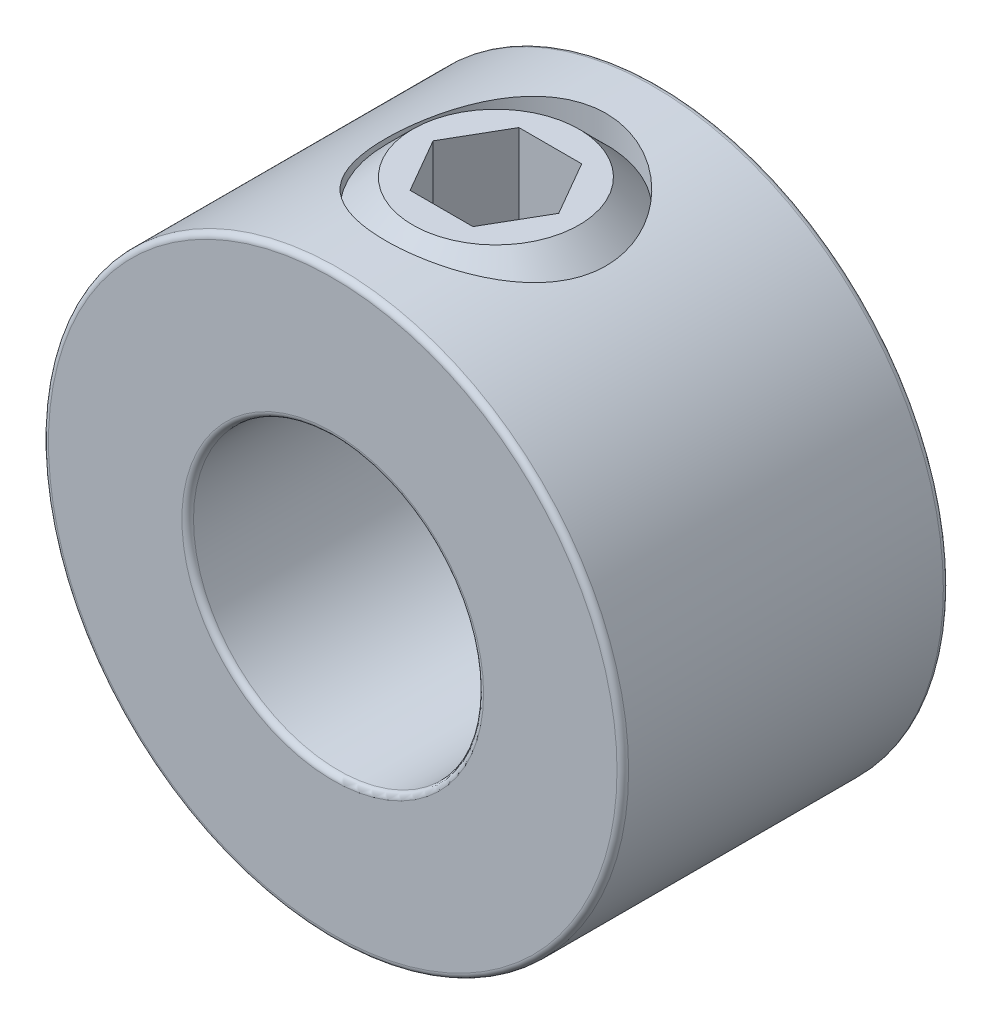
ISO-10303-21;
HEADER;
FILE_DESCRIPTION(('STEP AP214'),'2;1');
FILE_NAME('part.step','',(''),(''),'','','');
FILE_SCHEMA(('AUTOMOTIVE_DESIGN { 1 0 10303 214 1 1 1 1 }'));
ENDSEC;
DATA;
#1=APPLICATION_CONTEXT('core data for automotive mechanical design processes');
#2=APPLICATION_PROTOCOL_DEFINITION('international standard','automotive_design',2000,#1);
#3=PRODUCT_CONTEXT('',#1,'mechanical');
#4=PRODUCT('Part','Part','',(#3));
#5=PRODUCT_RELATED_PRODUCT_CATEGORY('part','',(#4));
#6=PRODUCT_DEFINITION_FORMATION('','',#4);
#7=PRODUCT_DEFINITION_CONTEXT('part definition',#1,'design');
#8=PRODUCT_DEFINITION('design','',#6,#7);
#9=PRODUCT_DEFINITION_SHAPE('','',#8);
#10=(LENGTH_UNIT() NAMED_UNIT(*) SI_UNIT(.MILLI.,.METRE.));
#11=(NAMED_UNIT(*) PLANE_ANGLE_UNIT() SI_UNIT($,.RADIAN.));
#12=(NAMED_UNIT(*) SI_UNIT($,.STERADIAN.) SOLID_ANGLE_UNIT());
#13=UNCERTAINTY_MEASURE_WITH_UNIT(LENGTH_MEASURE(1.E-05),#10,'distance_accuracy_value','');
#14=(GEOMETRIC_REPRESENTATION_CONTEXT(3) GLOBAL_UNCERTAINTY_ASSIGNED_CONTEXT((#13)) GLOBAL_UNIT_ASSIGNED_CONTEXT((#10,
#11,#12)) REPRESENTATION_CONTEXT('',''));
#15=CARTESIAN_POINT('',(0.,0.,0.));
#16=DIRECTION('',(0.,0.,1.));
#17=DIRECTION('',(1.,0.,0.));
#18=AXIS2_PLACEMENT_3D('',#15,#16,#17);
#19=CARTESIAN_POINT('',(0.,6.35,0.));
#20=DIRECTION('',(0.,1.,0.));
#21=DIRECTION('',(-1.,0.,0.));
#22=AXIS2_PLACEMENT_3D('',#19,#20,#21);
#23=PLANE('',#22);
#24=CARTESIAN_POINT('',(0.,6.35,0.));
#25=DIRECTION('',(0.,1.,0.));
#26=DIRECTION('',(-1.,0.,0.));
#27=AXIS2_PLACEMENT_3D('',#24,#25,#26);
#28=CIRCLE('',#27,1.81975161629017);
#29=CARTESIAN_POINT('',(-1.81975161629017,6.35,0.));
#30=VERTEX_POINT('',#29);
#31=EDGE_CURVE('E12',#30,#30,#28,.T.);
#32=ORIENTED_EDGE('',*,*,#31,.T.);
#33=EDGE_LOOP('',(#32));
#34=FACE_BOUND('',#33,.T.);
#35=DIRECTION('',(1.,0.,0.));
#36=VECTOR('',#35,1.);
#37=CARTESIAN_POINT('',(-0.687407664253899,6.34999999999999,-1.190625));
#38=LINE('',#37,#36);
#39=CARTESIAN_POINT('',(-0.687407664253899,6.34999999999999,-1.190625));
#40=VERTEX_POINT('',#39);
#41=CARTESIAN_POINT('',(0.687407664253899,6.35,-1.190625));
#42=VERTEX_POINT('',#41);
#43=EDGE_CURVE('E110',#40,#42,#38,.T.);
#44=ORIENTED_EDGE('',*,*,#43,.T.);
#45=DIRECTION('',(0.5,0.,0.866025403784439));
#46=VECTOR('',#45,1.);
#47=CARTESIAN_POINT('',(0.687407664253899,6.34999999999999,-1.190625));
#48=LINE('',#47,#46);
#49=CARTESIAN_POINT('',(1.3748153285078,6.34999999999999,0.));
#50=VERTEX_POINT('',#49);
#51=EDGE_CURVE('E56',#42,#50,#48,.T.);
#52=ORIENTED_EDGE('',*,*,#51,.T.);
#53=DIRECTION('',(-0.5,0.,0.866025403784439));
#54=VECTOR('',#53,1.);
#55=CARTESIAN_POINT('',(1.3748153285078,6.34999999999999,0.));
#56=LINE('',#55,#54);
#57=CARTESIAN_POINT('',(0.687407664253899,6.34999999999999,1.190625));
#58=VERTEX_POINT('',#57);
#59=EDGE_CURVE('E114',#50,#58,#56,.T.);
#60=ORIENTED_EDGE('',*,*,#59,.T.);
#61=DIRECTION('',(-1.,0.,0.));
#62=VECTOR('',#61,1.);
#63=CARTESIAN_POINT('',(0.687407664253899,6.34999999999999,1.190625));
#64=LINE('',#63,#62);
#65=CARTESIAN_POINT('',(-0.687407664253899,6.34999999999999,1.190625));
#66=VERTEX_POINT('',#65);
#67=EDGE_CURVE('E177',#58,#66,#64,.T.);
#68=ORIENTED_EDGE('',*,*,#67,.T.);
#69=DIRECTION('',(-0.5,0.,-0.866025403784439));
#70=VECTOR('',#69,1.);
#71=CARTESIAN_POINT('',(-0.687407664253899,6.34999999999999,1.190625));
#72=LINE('',#71,#70);
#73=CARTESIAN_POINT('',(-1.3748153285078,6.34999999999999,0.));
#74=VERTEX_POINT('',#73);
#75=EDGE_CURVE('E162',#66,#74,#72,.T.);
#76=ORIENTED_EDGE('',*,*,#75,.T.);
#77=DIRECTION('',(0.5,0.,-0.866025403784439));
#78=VECTOR('',#77,1.);
#79=CARTESIAN_POINT('',(-1.3748153285078,6.34999999999999,0.));
#80=LINE('',#79,#78);
#81=EDGE_CURVE('E158',#74,#40,#80,.T.);
#82=ORIENTED_EDGE('',*,*,#81,.T.);
#83=EDGE_LOOP('',(#44,#52,#60,#68,#76,#82));
#84=FACE_BOUND('',#83,.T.);
#85=ADVANCED_FACE('F42',(#34,#84),#23,.T.);
#86=CARTESIAN_POINT('',(0.,6.35,0.));
#87=DIRECTION('',(0.,-1.,0.));
#88=DIRECTION('',(1.,0.,0.));
#89=AXIS2_PLACEMENT_3D('',#86,#87,#88);
#90=CONICAL_SURFACE('',#89,1.81975161629017,0.785398163397449);
#91=CARTESIAN_POINT('',(0.,5.75675161629017,0.));
#92=DIRECTION('',(0.,1.,0.));
#93=DIRECTION('',(-1.,0.,0.));
#94=AXIS2_PLACEMENT_3D('',#91,#92,#93);
#95=CIRCLE('',#94,2.413);
#96=CARTESIAN_POINT('',(-2.413,5.75675161629017,0.));
#97=VERTEX_POINT('',#96);
#98=EDGE_CURVE('E49',#97,#97,#95,.T.);
#99=ORIENTED_EDGE('',*,*,#98,.T.);
#100=EDGE_LOOP('',(#99));
#101=FACE_BOUND('',#100,.T.);
#102=ORIENTED_EDGE('',*,*,#31,.F.);
#103=EDGE_LOOP('',(#102));
#104=FACE_BOUND('',#103,.T.);
#105=ADVANCED_FACE('F132',(#101,#104),#90,.T.);
#106=CARTESIAN_POINT('',(0.,3.175,0.));
#107=DIRECTION('',(0.,1.,0.));
#108=DIRECTION('',(-1.,0.,0.));
#109=AXIS2_PLACEMENT_3D('',#106,#107,#108);
#110=CYLINDRICAL_SURFACE('',#109,2.413);
#111=CARTESIAN_POINT('',(0.,3.76824838370983,0.));
#112=DIRECTION('',(0.,1.,0.));
#113=DIRECTION('',(-1.,0.,0.));
#114=AXIS2_PLACEMENT_3D('',#111,#112,#113);
#115=CIRCLE('',#114,2.413);
#116=CARTESIAN_POINT('',(-2.413,3.76824838370983,0.));
#117=VERTEX_POINT('',#116);
#118=EDGE_CURVE('E127',#117,#117,#115,.T.);
#119=ORIENTED_EDGE('',*,*,#118,.T.);
#120=EDGE_LOOP('',(#119));
#121=FACE_BOUND('',#120,.T.);
#122=ORIENTED_EDGE('',*,*,#98,.F.);
#123=EDGE_LOOP('',(#122));
#124=FACE_BOUND('',#123,.T.);
#125=ADVANCED_FACE('F135',(#121,#124),#110,.T.);
#126=CARTESIAN_POINT('',(0.,3.76824838370983,0.));
#127=DIRECTION('',(0.,1.,0.));
#128=DIRECTION('',(-1.,0.,0.));
#129=AXIS2_PLACEMENT_3D('',#126,#127,#128);
#130=CONICAL_SURFACE('',#129,2.413,0.785398163397448);
#131=CARTESIAN_POINT('',(0.,3.175,0.));
#132=DIRECTION('',(0.,1.,0.));
#133=DIRECTION('',(-1.,0.,0.));
#134=AXIS2_PLACEMENT_3D('',#131,#132,#133);
#135=CIRCLE('',#134,1.81975161629017);
#136=CARTESIAN_POINT('',(-1.81975161629017,3.175,0.));
#137=VERTEX_POINT('',#136);
#138=EDGE_CURVE('E119',#137,#137,#135,.T.);
#139=ORIENTED_EDGE('',*,*,#138,.T.);
#140=EDGE_LOOP('',(#139));
#141=FACE_BOUND('',#140,.T.);
#142=ORIENTED_EDGE('',*,*,#118,.F.);
#143=EDGE_LOOP('',(#142));
#144=FACE_BOUND('',#143,.T.);
#145=ADVANCED_FACE('F137',(#141,#144),#130,.T.);
#146=CARTESIAN_POINT('',(-1.81975161629017,3.175,0.));
#147=DIRECTION('',(0.,-1.,0.));
#148=DIRECTION('',(1.,0.,0.));
#149=AXIS2_PLACEMENT_3D('',#146,#147,#148);
#150=PLANE('',#149);
#151=CARTESIAN_POINT('',(0.,3.175,0.));
#152=DIRECTION('',(0.,1.,0.));
#153=DIRECTION('',(-1.,0.,0.));
#154=AXIS2_PLACEMENT_3D('',#151,#152,#153);
#155=CIRCLE('',#154,0.711898060451796);
#156=CARTESIAN_POINT('',(-0.711898060451796,3.175,0.));
#157=VERTEX_POINT('',#156);
#158=EDGE_CURVE('E115',#157,#157,#155,.T.);
#159=ORIENTED_EDGE('',*,*,#158,.T.);
#160=EDGE_LOOP('',(#159));
#161=FACE_BOUND('',#160,.T.);
#162=ORIENTED_EDGE('',*,*,#138,.F.);
#163=EDGE_LOOP('',(#162));
#164=FACE_BOUND('',#163,.T.);
#165=ADVANCED_FACE('F144',(#161,#164),#150,.T.);
#166=CARTESIAN_POINT('',(0.,3.175,0.));
#167=DIRECTION('',(0.,-1.,0.));
#168=DIRECTION('',(1.,0.,0.));
#169=AXIS2_PLACEMENT_3D('',#166,#167,#168);
#170=CONICAL_SURFACE('',#169,0.711898060451796,0.785398163397448);
#171=CARTESIAN_POINT('',(0.,3.8868980604518,0.));
#172=VERTEX_POINT('',#171);
#173=VERTEX_LOOP('',#172);
#174=FACE_BOUND('',#173,.T.);
#175=ORIENTED_EDGE('',*,*,#158,.F.);
#176=EDGE_LOOP('',(#175));
#177=FACE_BOUND('',#176,.T.);
#178=ADVANCED_FACE('F211',(#174,#177),#170,.F.);
#179=CARTESIAN_POINT('',(0.687407664253899,3.96874999999999,-1.190625));
#180=DIRECTION('',(-0.866025403784439,0.,0.5));
#181=DIRECTION('',(0.5,0.,0.866025403784438));
#182=AXIS2_PLACEMENT_3D('',#179,#180,#181);
#183=PLANE('',#182);
#184=ORIENTED_EDGE('',*,*,#51,.F.);
#185=DIRECTION('',(0.,1.,0.));
#186=VECTOR('',#185,1.);
#187=CARTESIAN_POINT('',(0.687407664253899,3.96874999999999,-1.190625));
#188=LINE('',#187,#186);
#189=CARTESIAN_POINT('',(0.687407664253899,3.96874999999999,-1.190625));
#190=VERTEX_POINT('',#189);
#191=EDGE_CURVE('E109',#190,#42,#188,.T.);
#192=ORIENTED_EDGE('',*,*,#191,.F.);
#193=DIRECTION('',(0.5,0.,0.866025403784439));
#194=VECTOR('',#193,1.);
#195=CARTESIAN_POINT('',(0.687407664253899,3.96874999999999,-1.190625));
#196=LINE('',#195,#194);
#197=CARTESIAN_POINT('',(1.3748153285078,3.96874999999999,0.));
#198=VERTEX_POINT('',#197);
#199=EDGE_CURVE('E100',#190,#198,#196,.T.);
#200=ORIENTED_EDGE('',*,*,#199,.T.);
#201=DIRECTION('',(0.,1.,0.));
#202=VECTOR('',#201,1.);
#203=CARTESIAN_POINT('',(1.3748153285078,3.96874999999999,0.));
#204=LINE('',#203,#202);
#205=EDGE_CURVE('E108',#198,#50,#204,.T.);
#206=ORIENTED_EDGE('',*,*,#205,.T.);
#207=EDGE_LOOP('',(#184,#192,#200,#206));
#208=FACE_BOUND('',#207,.T.);
#209=ADVANCED_FACE('F107',(#208),#183,.T.);
#210=CARTESIAN_POINT('',(1.3748153285078,3.96874999999999,0.));
#211=DIRECTION('',(-0.866025403784439,0.,-0.5));
#212=DIRECTION('',(-0.5,0.,0.866025403784439));
#213=AXIS2_PLACEMENT_3D('',#210,#211,#212);
#214=PLANE('',#213);
#215=ORIENTED_EDGE('',*,*,#59,.F.);
#216=ORIENTED_EDGE('',*,*,#205,.F.);
#217=DIRECTION('',(-0.5,0.,0.866025403784439));
#218=VECTOR('',#217,1.);
#219=CARTESIAN_POINT('',(1.3748153285078,3.96874999999999,0.));
#220=LINE('',#219,#218);
#221=CARTESIAN_POINT('',(0.687407664253899,3.96874999999999,1.190625));
#222=VERTEX_POINT('',#221);
#223=EDGE_CURVE('E96',#198,#222,#220,.T.);
#224=ORIENTED_EDGE('',*,*,#223,.T.);
#225=DIRECTION('',(0.,1.,0.));
#226=VECTOR('',#225,1.);
#227=CARTESIAN_POINT('',(0.687407664253899,3.96874999999999,1.190625));
#228=LINE('',#227,#226);
#229=EDGE_CURVE('E116',#222,#58,#228,.T.);
#230=ORIENTED_EDGE('',*,*,#229,.T.);
#231=EDGE_LOOP('',(#215,#216,#224,#230));
#232=FACE_BOUND('',#231,.T.);
#233=ADVANCED_FACE('F112',(#232),#214,.T.);
#234=CARTESIAN_POINT('',(0.687407664253899,3.96874999999999,1.190625));
#235=DIRECTION('',(0.,0.,-1.));
#236=DIRECTION('',(-1.,0.,0.));
#237=AXIS2_PLACEMENT_3D('',#234,#235,#236);
#238=PLANE('',#237);
#239=ORIENTED_EDGE('',*,*,#67,.F.);
#240=ORIENTED_EDGE('',*,*,#229,.F.);
#241=DIRECTION('',(-1.,0.,0.));
#242=VECTOR('',#241,1.);
#243=CARTESIAN_POINT('',(0.687407664253899,3.96874999999999,1.190625));
#244=LINE('',#243,#242);
#245=CARTESIAN_POINT('',(-0.687407664253899,3.96874999999999,1.190625));
#246=VERTEX_POINT('',#245);
#247=EDGE_CURVE('E102',#222,#246,#244,.T.);
#248=ORIENTED_EDGE('',*,*,#247,.T.);
#249=DIRECTION('',(0.,1.,0.));
#250=VECTOR('',#249,1.);
#251=CARTESIAN_POINT('',(-0.687407664253899,3.96874999999999,1.190625));
#252=LINE('',#251,#250);
#253=EDGE_CURVE('E121',#246,#66,#252,.T.);
#254=ORIENTED_EDGE('',*,*,#253,.T.);
#255=EDGE_LOOP('',(#239,#240,#248,#254));
#256=FACE_BOUND('',#255,.T.);
#257=ADVANCED_FACE('F175',(#256),#238,.T.);
#258=CARTESIAN_POINT('',(-0.687407664253899,3.96874999999999,1.190625));
#259=DIRECTION('',(0.866025403784439,0.,-0.5));
#260=DIRECTION('',(-0.5,0.,-0.866025403784438));
#261=AXIS2_PLACEMENT_3D('',#258,#259,#260);
#262=PLANE('',#261);
#263=ORIENTED_EDGE('',*,*,#75,.F.);
#264=ORIENTED_EDGE('',*,*,#253,.F.);
#265=DIRECTION('',(-0.5,0.,-0.866025403784439));
#266=VECTOR('',#265,1.);
#267=CARTESIAN_POINT('',(-0.687407664253899,3.96874999999999,1.190625));
#268=LINE('',#267,#266);
#269=CARTESIAN_POINT('',(-1.3748153285078,3.96874999999999,0.));
#270=VERTEX_POINT('',#269);
#271=EDGE_CURVE('E188',#246,#270,#268,.T.);
#272=ORIENTED_EDGE('',*,*,#271,.T.);
#273=DIRECTION('',(0.,1.,0.));
#274=VECTOR('',#273,1.);
#275=CARTESIAN_POINT('',(-1.3748153285078,3.96874999999999,0.));
#276=LINE('',#275,#274);
#277=EDGE_CURVE('E170',#270,#74,#276,.T.);
#278=ORIENTED_EDGE('',*,*,#277,.T.);
#279=EDGE_LOOP('',(#263,#264,#272,#278));
#280=FACE_BOUND('',#279,.T.);
#281=ADVANCED_FACE('F179',(#280),#262,.T.);
#282=CARTESIAN_POINT('',(-1.3748153285078,3.96874999999999,0.));
#283=DIRECTION('',(0.866025403784439,0.,0.5));
#284=DIRECTION('',(0.5,0.,-0.866025403784439));
#285=AXIS2_PLACEMENT_3D('',#282,#283,#284);
#286=PLANE('',#285);
#287=ORIENTED_EDGE('',*,*,#81,.F.);
#288=ORIENTED_EDGE('',*,*,#277,.F.);
#289=DIRECTION('',(0.5,0.,-0.866025403784439));
#290=VECTOR('',#289,1.);
#291=CARTESIAN_POINT('',(-1.3748153285078,3.96874999999999,0.));
#292=LINE('',#291,#290);
#293=CARTESIAN_POINT('',(-0.687407664253899,3.96874999999999,-1.190625));
#294=VERTEX_POINT('',#293);
#295=EDGE_CURVE('E186',#270,#294,#292,.T.);
#296=ORIENTED_EDGE('',*,*,#295,.T.);
#297=DIRECTION('',(0.,1.,0.));
#298=VECTOR('',#297,1.);
#299=CARTESIAN_POINT('',(-0.687407664253899,3.96874999999999,-1.190625));
#300=LINE('',#299,#298);
#301=EDGE_CURVE('E167',#294,#40,#300,.T.);
#302=ORIENTED_EDGE('',*,*,#301,.T.);
#303=EDGE_LOOP('',(#287,#288,#296,#302));
#304=FACE_BOUND('',#303,.T.);
#305=ADVANCED_FACE('F192',(#304),#286,.T.);
#306=CARTESIAN_POINT('',(-0.687407664253899,3.96874999999999,-1.190625));
#307=DIRECTION('',(0.,0.,1.));
#308=DIRECTION('',(1.,0.,0.));
#309=AXIS2_PLACEMENT_3D('',#306,#307,#308);
#310=PLANE('',#309);
#311=ORIENTED_EDGE('',*,*,#43,.F.);
#312=ORIENTED_EDGE('',*,*,#301,.F.);
#313=DIRECTION('',(1.,0.,0.));
#314=VECTOR('',#313,1.);
#315=CARTESIAN_POINT('',(-0.687407664253899,3.96874999999999,-1.190625));
#316=LINE('',#315,#314);
#317=EDGE_CURVE('E168',#294,#190,#316,.T.);
#318=ORIENTED_EDGE('',*,*,#317,.T.);
#319=ORIENTED_EDGE('',*,*,#191,.T.);
#320=EDGE_LOOP('',(#311,#312,#318,#319));
#321=FACE_BOUND('',#320,.T.);
#322=ADVANCED_FACE('F193',(#321),#310,.T.);
#323=CARTESIAN_POINT('',(1.3748153285078,3.96874999999999,0.));
#324=DIRECTION('',(0.,-1.,0.));
#325=DIRECTION('',(0.,0.,-1.));
#326=AXIS2_PLACEMENT_3D('',#323,#324,#325);
#327=PLANE('',#326);
#328=ORIENTED_EDGE('',*,*,#199,.F.);
#329=ORIENTED_EDGE('',*,*,#317,.F.);
#330=ORIENTED_EDGE('',*,*,#295,.F.);
#331=ORIENTED_EDGE('',*,*,#271,.F.);
#332=ORIENTED_EDGE('',*,*,#247,.F.);
#333=ORIENTED_EDGE('',*,*,#223,.F.);
#334=EDGE_LOOP('',(#328,#329,#330,#331,#332,#333));
#335=FACE_BOUND('',#334,.T.);
#336=ADVANCED_FACE('F98',(#335),#327,.F.);
#337=CLOSED_SHELL('',(#85,#105,#125,#145,#165,#178,#209,#233,#257,#281,#305,#322,#336));
#338=MANIFOLD_SOLID_BREP('B2',#337);
#339=CARTESIAN_POINT('',(0.,0.,3.571875));
#340=DIRECTION('',(0.,0.,1.));
#341=DIRECTION('',(1.,0.,0.));
#342=AXIS2_PLACEMENT_3D('',#339,#340,#341);
#343=PLANE('',#342);
#344=CARTESIAN_POINT('',(0.,0.,3.571875));
#345=DIRECTION('',(0.,0.,1.));
#346=DIRECTION('',(1.,0.,0.));
#347=AXIS2_PLACEMENT_3D('',#344,#345,#346);
#348=CIRCLE('',#347,3.302);
#349=CARTESIAN_POINT('',(3.302,0.,3.571875));
#350=VERTEX_POINT('',#349);
#351=EDGE_CURVE('E307',#350,#350,#348,.F.);
#352=ORIENTED_EDGE('',*,*,#351,.T.);
#353=EDGE_LOOP('',(#352));
#354=FACE_BOUND('',#353,.T.);
#355=CARTESIAN_POINT('',(0.,0.,3.571875));
#356=DIRECTION('',(0.,0.,1.));
#357=DIRECTION('',(1.,0.,0.));
#358=AXIS2_PLACEMENT_3D('',#355,#356,#357);
#359=CIRCLE('',#358,6.223);
#360=CARTESIAN_POINT('',(6.223,0.,3.571875));
#361=VERTEX_POINT('',#360);
#362=EDGE_CURVE('E311',#361,#361,#359,.T.);
#363=ORIENTED_EDGE('',*,*,#362,.T.);
#364=EDGE_LOOP('',(#363));
#365=FACE_BOUND('',#364,.T.);
#366=ADVANCED_FACE('F296',(#354,#365),#343,.T.);
#367=CARTESIAN_POINT('',(0.,0.,-3.571875));
#368=DIRECTION('',(0.,0.,1.));
#369=DIRECTION('',(1.,0.,0.));
#370=AXIS2_PLACEMENT_3D('',#367,#368,#369);
#371=PLANE('',#370);
#372=CARTESIAN_POINT('',(0.,0.,-3.571875));
#373=DIRECTION('',(0.,0.,1.));
#374=DIRECTION('',(1.,0.,0.));
#375=AXIS2_PLACEMENT_3D('',#372,#373,#374);
#376=CIRCLE('',#375,3.302);
#377=CARTESIAN_POINT('',(3.302,0.,-3.571875));
#378=VERTEX_POINT('',#377);
#379=EDGE_CURVE('E322',#378,#378,#376,.T.);
#380=ORIENTED_EDGE('',*,*,#379,.T.);
#381=EDGE_LOOP('',(#380));
#382=FACE_BOUND('',#381,.T.);
#383=CARTESIAN_POINT('',(0.,0.,-3.571875));
#384=DIRECTION('',(0.,0.,1.));
#385=DIRECTION('',(1.,0.,0.));
#386=AXIS2_PLACEMENT_3D('',#383,#384,#385);
#387=CIRCLE('',#386,6.223);
#388=CARTESIAN_POINT('',(6.223,0.,-3.571875));
#389=VERTEX_POINT('',#388);
#390=EDGE_CURVE('E325',#389,#389,#387,.F.);
#391=ORIENTED_EDGE('',*,*,#390,.T.);
#392=EDGE_LOOP('',(#391));
#393=FACE_BOUND('',#392,.T.);
#394=ADVANCED_FACE('F359',(#382,#393),#371,.F.);
#395=CARTESIAN_POINT('',(0.,0.,3.571875));
#396=DIRECTION('',(0.,0.,-1.));
#397=DIRECTION('',(-1.,0.,0.));
#398=AXIS2_PLACEMENT_3D('',#395,#396,#397);
#399=CYLINDRICAL_SURFACE('',#398,6.35);
#400=CARTESIAN_POINT('',(0.,0.,-3.444875));
#401=DIRECTION('',(0.,0.,1.));
#402=DIRECTION('',(1.,0.,0.));
#403=AXIS2_PLACEMENT_3D('',#400,#401,#402);
#404=CIRCLE('',#403,6.35);
#405=CARTESIAN_POINT('',(6.35,0.,-3.444875));
#406=VERTEX_POINT('',#405);
#407=EDGE_CURVE('E41',#406,#406,#404,.T.);
#408=ORIENTED_EDGE('',*,*,#407,.T.);
#409=EDGE_LOOP('',(#408));
#410=FACE_BOUND('',#409,.T.);
#411=CARTESIAN_POINT('',(0.,0.,3.444875));
#412=DIRECTION('',(0.,0.,1.));
#413=DIRECTION('',(1.,0.,0.));
#414=AXIS2_PLACEMENT_3D('',#411,#412,#413);
#415=CIRCLE('',#414,6.35);
#416=CARTESIAN_POINT('',(6.35,0.,3.444875));
#417=VERTEX_POINT('',#416);
#418=EDGE_CURVE('E303',#417,#417,#415,.F.);
#419=ORIENTED_EDGE('',*,*,#418,.T.);
#420=EDGE_LOOP('',(#419));
#421=FACE_BOUND('',#420,.T.);
#422=CARTESIAN_POINT('',(0.,6.35,-2.413));
#423=CARTESIAN_POINT('',(0.130555931467962,6.35000398969011,-2.41300527534602));
#424=CARTESIAN_POINT('',(0.261076241377739,6.34593890816647,-2.4023714543113));
#425=CARTESIAN_POINT('',(0.518209446534913,6.33012963929965,-2.36029479676423));
#426=CARTESIAN_POINT('',(0.644823015088655,6.31838678300935,-2.32885556715778));
#427=CARTESIAN_POINT('',(0.890396734122701,6.28848040494,-2.24644511602075));
#428=CARTESIAN_POINT('',(1.00937135935963,6.27032947705095,-2.19551218938446));
#429=CARTESIAN_POINT('',(1.23707694907279,6.22940932060409,-2.07575764561934));
#430=CARTESIAN_POINT('',(1.34580507871092,6.20663881943741,-2.00693109764769));
#431=CARTESIAN_POINT('',(1.5546544090621,6.15771932779737,-1.85022277092613));
#432=CARTESIAN_POINT('',(1.65427192875035,6.13147296383124,-1.76170041624995));
#433=CARTESIAN_POINT('',(1.83765571561736,6.07903240405007,-1.56947315042905));
#434=CARTESIAN_POINT('',(1.92141693988139,6.05283822744466,-1.46576342765122));
#435=CARTESIAN_POINT('',(2.07395660623911,6.00232668170519,-1.24113386470124));
#436=CARTESIAN_POINT('',(2.14201618015845,5.97812365120729,-1.11969756154783));
#437=CARTESIAN_POINT('',(2.25652093858858,5.93585432476053,-0.866038380432351));
#438=CARTESIAN_POINT('',(2.30297502037546,5.91778550353544,-0.733819969020803));
#439=CARTESIAN_POINT('',(2.37094947712185,5.89087364983883,-0.46815363189803));
#440=CARTESIAN_POINT('',(2.39343294050412,5.88167580744491,-0.334989300795486));
#441=CARTESIAN_POINT('',(2.41583880524757,5.87251090464605,-0.0664845962936197));
#442=CARTESIAN_POINT('',(2.41577084821779,5.87253989940926,0.0688548224232351));
#443=CARTESIAN_POINT('',(2.39381090108878,5.88152011871453,0.328972227003014));
#444=CARTESIAN_POINT('',(2.37326609797153,5.88992057372023,0.453886522563246));
#445=CARTESIAN_POINT('',(2.31316652422954,5.91378008823147,0.698339704990829));
#446=CARTESIAN_POINT('',(2.27360881167116,5.92924024008996,0.817877756841903));
#447=CARTESIAN_POINT('',(2.17588364092748,5.96580146890692,1.0508916152852));
#448=CARTESIAN_POINT('',(2.11737290423754,5.98700531598431,1.16420661484106));
#449=CARTESIAN_POINT('',(1.98364217411328,6.03263175509447,1.37979639920587));
#450=CARTESIAN_POINT('',(1.90841630395244,6.05705547794376,1.4820672822727));
#451=CARTESIAN_POINT('',(1.73726689770536,6.10842961274997,1.68010694238863));
#452=CARTESIAN_POINT('',(1.64027173491613,6.13543795015635,1.77493688260015));
#453=CARTESIAN_POINT('',(1.43144868882472,6.18748920351012,1.94726806056401));
#454=CARTESIAN_POINT('',(1.31961840653187,6.2125318005324,2.02476649017818));
#455=CARTESIAN_POINT('',(1.08185265975391,6.25835188225341,2.16130771487283));
#456=CARTESIAN_POINT('',(0.955717417234618,6.27905339803369,2.22002994310971));
#457=CARTESIAN_POINT('',(0.694375189035109,6.31329326294077,2.31510736575226));
#458=CARTESIAN_POINT('',(0.559172376611221,6.32683488218724,2.3514727723643));
#459=CARTESIAN_POINT('',(0.291428150212525,6.3446501972992,2.39898109857718));
#460=CARTESIAN_POINT('',(0.159141645079808,6.34938771868047,2.41138775288999));
#461=CARTESIAN_POINT('',(-0.105693065348276,6.35049981057155,2.41431626348443));
#462=CARTESIAN_POINT('',(-0.238241203822052,6.34687629478166,2.40484312768025));
#463=CARTESIAN_POINT('',(-0.494323602805378,6.33197908606406,2.36523562382545));
#464=CARTESIAN_POINT('',(-0.61800684441211,6.32101461634214,2.33593589818825));
#465=CARTESIAN_POINT('',(-0.858609565436108,6.29285092848222,2.25861304376362));
#466=CARTESIAN_POINT('',(-0.975528163914414,6.27565090041604,2.21058748264173));
#467=CARTESIAN_POINT('',(-1.20317276582384,6.23607457125026,2.09563503714011));
#468=CARTESIAN_POINT('',(-1.3136121499673,6.21355984396609,2.02818967610491));
#469=CARTESIAN_POINT('',(-1.52197988578177,6.16583504517286,1.87689595883598));
#470=CARTESIAN_POINT('',(-1.61990351002366,6.14062396176678,1.79304143465584));
#471=CARTESIAN_POINT('',(-1.80656807112922,6.08841217199752,1.60543272496061));
#472=CARTESIAN_POINT('',(-1.89441393314817,6.06139435477813,1.5007904098217));
#473=CARTESIAN_POINT('',(-2.05148411432654,6.01005496187559,1.27772800811267));
#474=CARTESIAN_POINT('',(-2.12070651399853,5.98573366426972,1.15930650314625));
#475=CARTESIAN_POINT('',(-2.23870023772464,5.94261798623815,0.910922748538602));
#476=CARTESIAN_POINT('',(-2.28736466342468,5.92385264334907,0.780904332023381));
#477=CARTESIAN_POINT('',(-2.36177800946808,5.89458517077402,0.513602694331982));
#478=CARTESIAN_POINT('',(-2.38754162954713,5.8840777409413,0.376324193363579));
#479=CARTESIAN_POINT('',(-2.41408994040532,5.87323215610138,0.108127165215383));
#480=CARTESIAN_POINT('',(-2.41640623148607,5.87227054588007,-0.0226157343841075));
#481=CARTESIAN_POINT('',(-2.3999373204655,5.8790202253426,-0.282524873396556));
#482=CARTESIAN_POINT('',(-2.38115423316032,5.88673064582666,-0.41169126951125));
#483=CARTESIAN_POINT('',(-2.32422421188573,5.90943043237583,-0.660552265849344));
#484=CARTESIAN_POINT('',(-2.28672002796391,5.92417751295514,-0.780417919491674));
#485=CARTESIAN_POINT('',(-2.19398528189399,5.95914188552999,-1.01222145618602));
#486=CARTESIAN_POINT('',(-2.13875018285588,5.97936057736356,-1.12415730124382));
#487=CARTESIAN_POINT('',(-2.00869997639504,6.02433337271119,-1.34342800575803));
#488=CARTESIAN_POINT('',(-1.93299650808671,6.04927206356278,-1.4501976241717));
#489=CARTESIAN_POINT('',(-1.76551836882645,6.10025417003155,-1.65000619367226));
#490=CARTESIAN_POINT('',(-1.67373852090438,6.12629793945648,-1.74304070389426));
#491=CARTESIAN_POINT('',(-1.47055494697206,6.17831294001547,-1.91807209951937));
#492=CARTESIAN_POINT('',(-1.35833856072122,6.20419794006484,-1.99915556641372));
#493=CARTESIAN_POINT('',(-1.12096041375387,6.25144642675378,-2.14129762074769));
#494=CARTESIAN_POINT('',(-0.995797050693124,6.27280935273315,-2.20235372565052));
#495=CARTESIAN_POINT('',(-0.728778395788011,6.30955475572144,-2.30499263616226));
#496=CARTESIAN_POINT('',(-0.58638469778337,6.32454657619379,-2.3453288052365));
#497=CARTESIAN_POINT('',(-0.295976705251577,6.34476431329028,-2.39932232882264));
#498=CARTESIAN_POINT('',(-0.147965475024477,6.34999547828747,-2.41299402119021));
#499=CARTESIAN_POINT('',(0.,6.35,-2.413));
#500=B_SPLINE_CURVE_WITH_KNOTS('',3,(#422,#423,#424,#425,#426,#427,#428,#429,#430,#431,#432,
#433,#434,#435,#436,#437,#438,#439,#440,#441,#442,#443,#444,#445,#446,#447,#448,#449,#450,#451,
#452,#453,#454,#455,#456,#457,#458,#459,#460,#461,#462,#463,#464,#465,#466,#467,#468,#469,#470,
#471,#472,#473,#474,#475,#476,#477,#478,#479,#480,#481,#482,#483,#484,#485,#486,#487,#488,#489,
#490,#491,#492,#493,#494,#495,#496,#497,#498,#499),.UNSPECIFIED.,.T.,.F.,(4,2,2,2,2,2,2,2,2,2,2,
2,2,2,2,2,2,2,2,2,2,2,2,2,2,2,2,2,2,2,2,2,2,2,2,2,2,2,4),(0.,0.391121887064184,
0.782175985486185,1.17246577830223,1.56286323524963,1.96854634212709,2.37435825594016,
2.79613130529395,3.21773051175688,3.62166628723491,4.02542936468621,4.40427313209371,
4.78317553819666,5.16936515238192,5.55569075901495,5.96873424705112,6.38184461005431,
6.80167192308661,7.22130732355892,7.61812936188612,8.01486058335588,8.39585156202364,
8.77689204483065,9.16923685274999,9.56172942118012,9.9776135359701,10.3935404987953,
10.8116043631128,11.2293996833676,11.6197130905881,12.0099873800853,12.3876994067832,
12.7655081575183,13.1635000328781,13.5616203073395,13.9821012344605,14.4026342635628,
14.8461505355472,15.2894282569131),.UNSPECIFIED.);
#501=CARTESIAN_POINT('',(0.,6.35,-2.413));
#502=VERTEX_POINT('',#501);
#503=EDGE_CURVE('E328',#502,#502,#500,.T.);
#504=ORIENTED_EDGE('',*,*,#503,.T.);
#505=EDGE_LOOP('',(#504));
#506=FACE_BOUND('',#505,.T.);
#507=ADVANCED_FACE('F355',(#410,#421,#506),#399,.T.);
#508=CARTESIAN_POINT('',(0.,0.,3.571875));
#509=DIRECTION('',(0.,0.,-1.));
#510=DIRECTION('',(-1.,0.,0.));
#511=AXIS2_PLACEMENT_3D('',#508,#509,#510);
#512=CYLINDRICAL_SURFACE('',#511,3.175);
#513=CARTESIAN_POINT('',(0.,0.,-3.444875));
#514=DIRECTION('',(0.,0.,1.));
#515=DIRECTION('',(1.,0.,0.));
#516=AXIS2_PLACEMENT_3D('',#513,#514,#515);
#517=CIRCLE('',#516,3.175);
#518=CARTESIAN_POINT('',(3.175,0.,-3.444875));
#519=VERTEX_POINT('',#518);
#520=EDGE_CURVE('E316',#519,#519,#517,.F.);
#521=ORIENTED_EDGE('',*,*,#520,.T.);
#522=EDGE_LOOP('',(#521));
#523=FACE_BOUND('',#522,.T.);
#524=CARTESIAN_POINT('',(0.,0.,3.444875));
#525=DIRECTION('',(0.,0.,1.));
#526=DIRECTION('',(1.,0.,0.));
#527=AXIS2_PLACEMENT_3D('',#524,#525,#526);
#528=CIRCLE('',#527,3.175);
#529=CARTESIAN_POINT('',(3.175,0.,3.444875));
#530=VERTEX_POINT('',#529);
#531=EDGE_CURVE('E319',#530,#530,#528,.T.);
#532=ORIENTED_EDGE('',*,*,#531,.T.);
#533=EDGE_LOOP('',(#532));
#534=FACE_BOUND('',#533,.T.);
#535=CARTESIAN_POINT('',(0.,3.175,-2.413));
#536=CARTESIAN_POINT('',(0.117443171605231,3.17499092904906,-2.41299058031907));
#537=CARTESIAN_POINT('',(0.23503818841931,3.16841692674332,-2.4043581847269));
#538=CARTESIAN_POINT('',(0.466484967913331,3.14271336140829,-2.37038175457781));
#539=CARTESIAN_POINT('',(0.580328596183407,3.12355818632314,-2.34500362950094));
#540=CARTESIAN_POINT('',(0.80033693546367,3.07452724978738,-2.27928432631256));
#541=CARTESIAN_POINT('',(0.906543039514099,3.04471549355359,-2.23903243487973));
#542=CARTESIAN_POINT('',(1.10997011785933,2.97659455342082,-2.14548015839209));
#543=CARTESIAN_POINT('',(1.20719255384311,2.93828675533249,-2.09218190121579));
#544=CARTESIAN_POINT('',(1.40022726688529,2.85170030734834,-1.96882085307546));
#545=CARTESIAN_POINT('',(1.49506365463583,2.80282512985173,-1.89765858122501));
#546=CARTESIAN_POINT('',(1.67223382567996,2.7008760546092,-1.7435641158176));
#547=CARTESIAN_POINT('',(1.75454859398162,2.64779595363648,-1.66061438438314));
#548=CARTESIAN_POINT('',(1.92203888294129,2.5296135351956,-1.46565859240837));
#549=CARTESIAN_POINT('',(2.00423140536036,2.4643124367144,-1.35120048467098));
#550=CARTESIAN_POINT('',(2.14857118710811,2.33951215894306,-1.10735736644856));
#551=CARTESIAN_POINT('',(2.21074385995913,2.28000569136514,-0.977991565717825));
#552=CARTESIAN_POINT('',(2.29462037317499,2.19490180220151,-0.752497308608559));
#553=CARTESIAN_POINT('',(2.32287346332998,2.16472241167552,-0.66055827907226));
#554=CARTESIAN_POINT('',(2.36849823013454,2.11470881226284,-0.47139038700259));
#555=CARTESIAN_POINT('',(2.38589523743028,2.09485053921884,-0.374174418255039));
#556=CARTESIAN_POINT('',(2.40870358471578,2.06860028206587,-0.175460476777278));
#557=CARTESIAN_POINT('',(2.4139959431512,2.06234200752845,-0.073929905731699));
#558=CARTESIAN_POINT('',(2.41169213967819,2.06503422028968,0.128798184800726));
#559=CARTESIAN_POINT('',(2.40409306334661,2.07398814667793,0.22999562379254));
#560=CARTESIAN_POINT('',(2.37836508518799,2.10340433920656,0.416917246134645));
#561=CARTESIAN_POINT('',(2.36156171265492,2.1224091464969,0.503073429560243));
#562=CARTESIAN_POINT('',(2.31942910669347,2.16837457604816,0.671064962974234));
#563=CARTESIAN_POINT('',(2.29409116468348,2.19534332114491,0.752895800354834));
#564=CARTESIAN_POINT('',(2.21702947004233,2.27376916611904,0.962631680289748));
#565=CARTESIAN_POINT('',(2.15880606368402,2.32983777456744,1.08642083974007));
#566=CARTESIAN_POINT('',(2.0240584670168,2.44783368287627,1.32063556736185));
#567=CARTESIAN_POINT('',(1.94748865288627,2.50977535205404,1.43102676980356));
#568=CARTESIAN_POINT('',(1.77457755480707,2.63500191833982,1.64086400526623));
#569=CARTESIAN_POINT('',(1.67772908569284,2.69827393808612,1.73990181478264));
#570=CARTESIAN_POINT('',(1.46641465679805,2.81868720555883,1.92133244794249));
#571=CARTESIAN_POINT('',(1.35198192561174,2.87583967861316,2.00375600179513));
#572=CARTESIAN_POINT('',(1.1302184691796,2.96897239724258,2.13504920976438));
#573=CARTESIAN_POINT('',(1.02573469648465,3.00691100546587,2.18732233798596));
#574=CARTESIAN_POINT('',(0.807524498934965,3.07269924184988,2.27691743542351));
#575=CARTESIAN_POINT('',(0.693803632023793,3.10055488265641,2.31424831636675));
#576=CARTESIAN_POINT('',(0.458986561176873,3.14392869528766,2.37204565582169));
#577=CARTESIAN_POINT('',(0.337846653718269,3.15936426972399,2.39239924216467));
#578=CARTESIAN_POINT('',(0.0929212408274502,3.17600778354888,2.41433718167044));
#579=CARTESIAN_POINT('',(-0.0308628412677098,3.17722319336241,2.41593138989231));
#580=CARTESIAN_POINT('',(-0.263113673769308,3.16598164725166,2.40112430213952));
#581=CARTESIAN_POINT('',(-0.371784896474092,3.15499411480433,2.38665711938384));
#582=CARTESIAN_POINT('',(-0.584657379974265,3.12256258934286,2.34361709819449));
#583=CARTESIAN_POINT('',(-0.688857782558675,3.10111659842469,2.31504156459624));
#584=CARTESIAN_POINT('',(-0.893151752270642,3.04866013703249,2.24429284461138));
#585=CARTESIAN_POINT('',(-0.993066473951875,3.01741404656932,2.20178337061745));
#586=CARTESIAN_POINT('',(-1.18427030490273,2.94762615076737,2.10512741976429));
#587=CARTESIAN_POINT('',(-1.27555811070553,2.90908324556455,2.05097918840424));
#588=CARTESIAN_POINT('',(-1.4629408219305,2.82008518778891,1.92283493337221));
#589=CARTESIAN_POINT('',(-1.55736336530955,2.76871323654288,1.84703979297132));
#590=CARTESIAN_POINT('',(-1.7330266340156,2.66229345480278,1.68334400808498));
#591=CARTESIAN_POINT('',(-1.81424018707203,2.60723836781931,1.59541908083344));
#592=CARTESIAN_POINT('',(-1.93310120506622,2.51929011373857,1.44596227809647));
#593=CARTESIAN_POINT('',(-1.97518148865632,2.48634042838264,1.38794003709871));
#594=CARTESIAN_POINT('',(-2.05424288960517,2.42143291492003,1.26799956797446));
#595=CARTESIAN_POINT('',(-2.09122218168265,2.38947544500995,1.2060799567393));
#596=CARTESIAN_POINT('',(-2.19405069763864,2.29677780916441,1.01470921513655));
#597=CARTESIAN_POINT('',(-2.25209423008379,2.2389759481709,0.879267670433414));
#598=CARTESIAN_POINT('',(-2.32600727289693,2.16148731453314,0.648667618119571));
#599=CARTESIAN_POINT('',(-2.34951337659766,2.13568591161393,0.557995127674168));
#600=CARTESIAN_POINT('',(-2.38597736286025,2.09487284834006,0.372275602812797));
#601=CARTESIAN_POINT('',(-2.39896041795918,2.0798354491901,0.277239585981548));
#602=CARTESIAN_POINT('',(-2.41347202601588,2.06298898322372,0.0843820043038626));
#603=CARTESIAN_POINT('',(-2.41491881071071,2.06127434940024,-0.0134545208329241));
#604=CARTESIAN_POINT('',(-2.40600289841214,2.07166816759277,-0.20788213648133));
#605=CARTESIAN_POINT('',(-2.39562846174622,2.08379036100337,-0.304471892411458));
#606=CARTESIAN_POINT('',(-2.36137219311358,2.12256830664758,-0.508834367656112));
#607=CARTESIAN_POINT('',(-2.33557340769404,2.15126142901359,-0.615881798172457));
#608=CARTESIAN_POINT('',(-2.27108364148613,2.21923176610734,-0.822515613730422));
#609=CARTESIAN_POINT('',(-2.2323592210675,2.25853638265596,-0.922081817130457));
#610=CARTESIAN_POINT('',(-2.12610942507655,2.35955877527054,-1.15053309693759));
#611=CARTESIAN_POINT('',(-2.05324191025264,2.42403799567888,-1.27569998264042));
#612=CARTESIAN_POINT('',(-1.88728411653423,2.55539518076956,-1.5104318596925));
#613=CARTESIAN_POINT('',(-1.79417076882036,2.62227580852244,-1.61997881541957));
#614=CARTESIAN_POINT('',(-1.58693666845894,2.75272337581287,-1.82362287315767));
#615=CARTESIAN_POINT('',(-1.47252844795802,2.81622750409905,-1.9174704362987));
#616=CARTESIAN_POINT('',(-1.22472214874906,2.93245405690648,-2.0844185884594));
#617=CARTESIAN_POINT('',(-1.09136873492959,2.9852011492147,-2.15756679766189));
#618=CARTESIAN_POINT('',(-0.848324156263042,3.06143310070406,-2.2616762509508));
#619=CARTESIAN_POINT('',(-0.742491250018576,3.08897584082985,-2.29871569194653));
#620=CARTESIAN_POINT('',(-0.524711420429954,3.13329848559572,-2.35794338327758));
#621=CARTESIAN_POINT('',(-0.412780537897338,3.1501052759874,-2.38016873825137));
#622=CARTESIAN_POINT('',(-0.249887399880881,3.16554486424948,-2.40054788675386));
#623=CARTESIAN_POINT('',(-0.200104041382905,3.16908209053624,-2.40520884201812));
#624=CARTESIAN_POINT('',(-0.10022305414221,3.17381185752955,-2.41143725628489));
#625=CARTESIAN_POINT('',(-0.0501253573366512,3.17500387152911,-2.41300402036888));
#626=CARTESIAN_POINT('',(0.,3.175,-2.413));
#627=B_SPLINE_CURVE_WITH_KNOTS('',3,(#535,#536,#537,#538,#539,#540,#541,#542,#543,#544,#545,
#546,#547,#548,#549,#550,#551,#552,#553,#554,#555,#556,#557,#558,#559,#560,#561,#562,#563,#564,
#565,#566,#567,#568,#569,#570,#571,#572,#573,#574,#575,#576,#577,#578,#579,#580,#581,#582,#583,
#584,#585,#586,#587,#588,#589,#590,#591,#592,#593,#594,#595,#596,#597,#598,#599,#600,#601,#602,
#603,#604,#605,#606,#607,#608,#609,#610,#611,#612,#613,#614,#615,#616,#617,#618,#619,#620,#621,
#622,#623,#624,#625,#626),.UNSPECIFIED.,.T.,.F.,(4,2,2,2,2,2,2,2,2,2,2,2,2,2,2,2,2,2,2,2,2,2,2,
2,2,2,2,2,2,2,2,2,2,2,2,2,2,2,2,2,2,2,2,2,2,4),(0.,0.352113770291782,0.704946585369681,
1.05569488379078,1.40638601280107,1.78976092813112,2.17371233600607,2.63773050853704,
3.10115730525324,3.40258553658297,3.70330778533679,4.00697348207613,4.31070783899934,
4.57916413533347,4.84789519559245,5.28900480236595,5.73122295780719,6.18621377116464,
6.64035513804427,7.00739894320242,7.37422351187941,7.74346787257931,8.11251824563582,
8.44151894934109,8.77058252746343,9.10825790412116,9.44598421987268,9.83917081589853,
10.2331562784928,10.469557715449,10.7060435254032,11.1774135342105,11.4679029980311,
11.757695504225,12.0495402292483,12.3416750384965,12.6811651199407,13.0215403855346,
13.4947220530831,13.9684457327182,14.4491015240246,14.9286423754468,15.2736416515379,
15.6177735325977,15.768023783139,15.9183077742625),.UNSPECIFIED.);
#628=CARTESIAN_POINT('',(0.,3.175,-2.413));
#629=VERTEX_POINT('',#628);
#630=EDGE_CURVE('E329',#629,#629,#627,.T.);
#631=ORIENTED_EDGE('',*,*,#630,.F.);
#632=EDGE_LOOP('',(#631));
#633=FACE_BOUND('',#632,.T.);
#634=ADVANCED_FACE('F339',(#523,#534,#633),#512,.F.);
#635=CARTESIAN_POINT('',(0.,6.35,0.));
#636=DIRECTION('',(0.,-1.,0.));
#637=DIRECTION('',(0.,0.,-1.));
#638=AXIS2_PLACEMENT_3D('',#635,#636,#637);
#639=CYLINDRICAL_SURFACE('',#638,2.413);
#640=ORIENTED_EDGE('',*,*,#630,.T.);
#641=EDGE_LOOP('',(#640));
#642=FACE_BOUND('',#641,.T.);
#643=ORIENTED_EDGE('',*,*,#503,.F.);
#644=EDGE_LOOP('',(#643));
#645=FACE_BOUND('',#644,.T.);
#646=ADVANCED_FACE('F342',(#642,#645),#639,.F.);
#647=CARTESIAN_POINT('',(0.,0.,-3.444875));
#648=DIRECTION('',(0.,0.,1.));
#649=DIRECTION('',(1.,0.,0.));
#650=AXIS2_PLACEMENT_3D('',#647,#648,#649);
#651=TOROIDAL_SURFACE('',#650,3.302,0.127);
#652=ORIENTED_EDGE('',*,*,#520,.F.);
#653=EDGE_LOOP('',(#652));
#654=FACE_BOUND('',#653,.T.);
#655=ORIENTED_EDGE('',*,*,#379,.F.);
#656=EDGE_LOOP('',(#655));
#657=FACE_BOUND('',#656,.T.);
#658=ADVANCED_FACE('F345',(#654,#657),#651,.T.);
#659=CARTESIAN_POINT('',(0.,0.,3.444875));
#660=DIRECTION('',(0.,0.,1.));
#661=DIRECTION('',(1.,0.,0.));
#662=AXIS2_PLACEMENT_3D('',#659,#660,#661);
#663=TOROIDAL_SURFACE('',#662,3.302,0.127);
#664=ORIENTED_EDGE('',*,*,#351,.F.);
#665=EDGE_LOOP('',(#664));
#666=FACE_BOUND('',#665,.T.);
#667=ORIENTED_EDGE('',*,*,#531,.F.);
#668=EDGE_LOOP('',(#667));
#669=FACE_BOUND('',#668,.T.);
#670=ADVANCED_FACE('F352',(#666,#669),#663,.T.);
#671=CARTESIAN_POINT('',(0.,0.,-3.444875));
#672=DIRECTION('',(0.,0.,1.));
#673=DIRECTION('',(1.,0.,0.));
#674=AXIS2_PLACEMENT_3D('',#671,#672,#673);
#675=TOROIDAL_SURFACE('',#674,6.223,0.127);
#676=ORIENTED_EDGE('',*,*,#390,.F.);
#677=EDGE_LOOP('',(#676));
#678=FACE_BOUND('',#677,.T.);
#679=ORIENTED_EDGE('',*,*,#407,.F.);
#680=EDGE_LOOP('',(#679));
#681=FACE_BOUND('',#680,.T.);
#682=ADVANCED_FACE('F371',(#678,#681),#675,.T.);
#683=CARTESIAN_POINT('',(0.,0.,3.444875));
#684=DIRECTION('',(0.,0.,1.));
#685=DIRECTION('',(1.,0.,0.));
#686=AXIS2_PLACEMENT_3D('',#683,#684,#685);
#687=TOROIDAL_SURFACE('',#686,6.223,0.127);
#688=ORIENTED_EDGE('',*,*,#418,.F.);
#689=EDGE_LOOP('',(#688));
#690=FACE_BOUND('',#689,.T.);
#691=ORIENTED_EDGE('',*,*,#362,.F.);
#692=EDGE_LOOP('',(#691));
#693=FACE_BOUND('',#692,.T.);
#694=ADVANCED_FACE('F298',(#690,#693),#687,.T.);
#695=CLOSED_SHELL('',(#366,#394,#507,#634,#646,#658,#670,#682,#694));
#696=MANIFOLD_SOLID_BREP('B6',#695);
#697=ADVANCED_BREP_SHAPE_REPRESENTATION('',(#18,#338,#696),#14);
#698=SHAPE_DEFINITION_REPRESENTATION(#9,#697);
ENDSEC;
END-ISO-10303-21;
